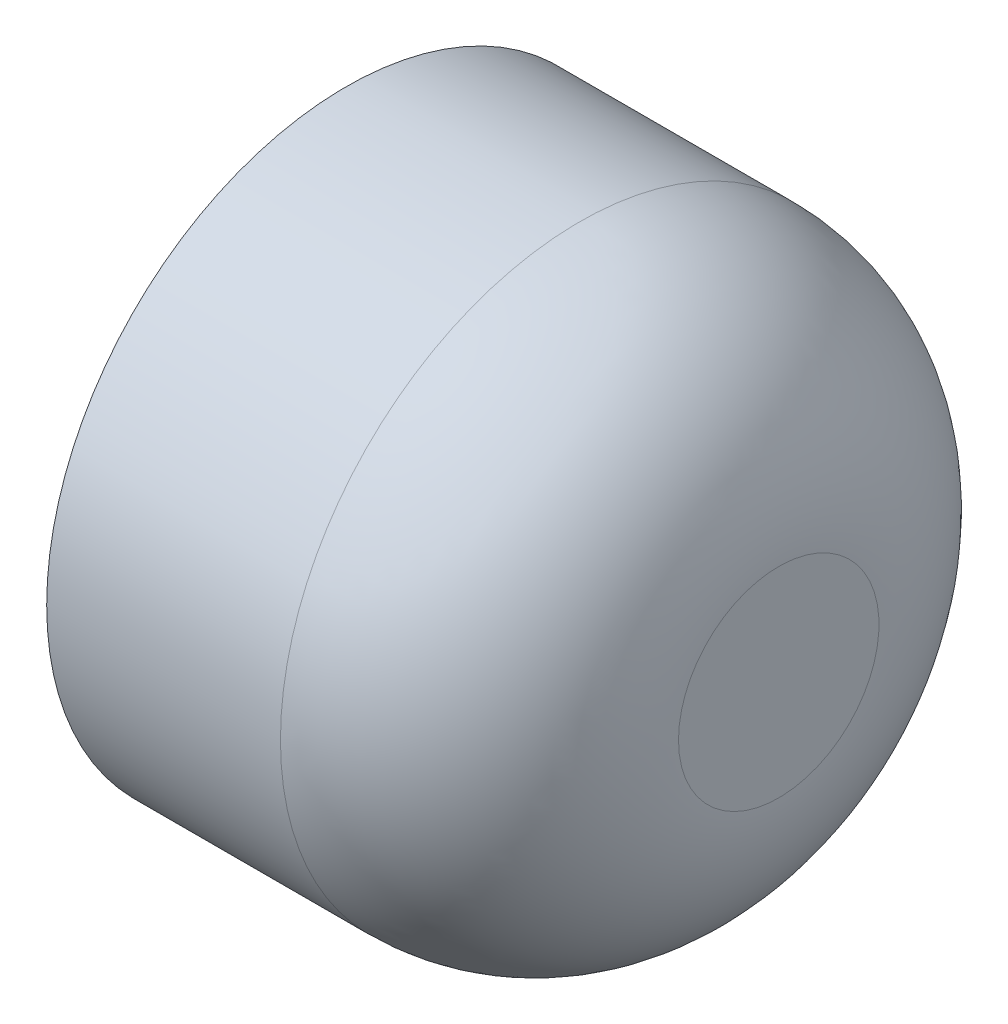
ISO-10303-21;
HEADER;
FILE_DESCRIPTION(('STEP AP214'),'2;1');
FILE_NAME('part.step','',(''),(''),'','','');
FILE_SCHEMA(('AUTOMOTIVE_DESIGN { 1 0 10303 214 1 1 1 1 }'));
ENDSEC;
DATA;
#1=APPLICATION_CONTEXT('core data for automotive mechanical design processes');
#2=APPLICATION_PROTOCOL_DEFINITION('international standard','automotive_design',2000,#1);
#3=PRODUCT_CONTEXT('',#1,'mechanical');
#4=PRODUCT('Part','Part','',(#3));
#5=PRODUCT_RELATED_PRODUCT_CATEGORY('part','',(#4));
#6=PRODUCT_DEFINITION_FORMATION('','',#4);
#7=PRODUCT_DEFINITION_CONTEXT('part definition',#1,'design');
#8=PRODUCT_DEFINITION('design','',#6,#7);
#9=PRODUCT_DEFINITION_SHAPE('','',#8);
#10=(LENGTH_UNIT() NAMED_UNIT(*) SI_UNIT(.MILLI.,.METRE.));
#11=(NAMED_UNIT(*) PLANE_ANGLE_UNIT() SI_UNIT($,.RADIAN.));
#12=(NAMED_UNIT(*) SI_UNIT($,.STERADIAN.) SOLID_ANGLE_UNIT());
#13=UNCERTAINTY_MEASURE_WITH_UNIT(LENGTH_MEASURE(1.E-05),#10,'distance_accuracy_value','');
#14=(GEOMETRIC_REPRESENTATION_CONTEXT(3) GLOBAL_UNCERTAINTY_ASSIGNED_CONTEXT((#13)) GLOBAL_UNIT_ASSIGNED_CONTEXT((#10,
#11,#12)) REPRESENTATION_CONTEXT('',''));
#15=CARTESIAN_POINT('',(0.,0.,0.));
#16=DIRECTION('',(0.,0.,1.));
#17=DIRECTION('',(1.,0.,0.));
#18=AXIS2_PLACEMENT_3D('',#15,#16,#17);
#19=CARTESIAN_POINT('',(7.06084768465247,0.,0.));
#20=DIRECTION('',(-1.,0.,0.));
#21=DIRECTION('',(0.,0.,1.));
#22=AXIS2_PLACEMENT_3D('',#19,#20,#21);
#23=DEGENERATE_TOROIDAL_SURFACE('',#22,9.52382631194564,30.5527329793909,.T.);
#24=CARTESIAN_POINT('',(13.9366262737168,0.,0.));
#25=DIRECTION('',(-1.,0.,0.));
#26=DIRECTION('',(0.,0.,1.));
#27=AXIS2_PLACEMENT_3D('',#24,#25,#26);
#28=CIRCLE('',#27,39.2928229578544);
#29=CARTESIAN_POINT('',(13.9366262737168,0.,39.2928229578544));
#30=VERTEX_POINT('',#29);
#31=EDGE_CURVE('E55',#30,#30,#28,.T.);
#32=ORIENTED_EDGE('',*,*,#31,.T.);
#33=EDGE_LOOP('',(#32));
#34=FACE_BOUND('',#33,.T.);
#35=CARTESIAN_POINT('',(37.6135806640434,0.,0.));
#36=DIRECTION('',(-1.,0.,0.));
#37=DIRECTION('',(0.,0.,1.));
#38=AXIS2_PLACEMENT_3D('',#35,#36,#37);
#39=CIRCLE('',#38,9.52382631194564);
#40=CARTESIAN_POINT('',(37.6135806640434,0.,9.52382631194564));
#41=VERTEX_POINT('',#40);
#42=EDGE_CURVE('E10',#41,#41,#39,.T.);
#43=ORIENTED_EDGE('',*,*,#42,.F.);
#44=EDGE_LOOP('',(#43));
#45=FACE_BOUND('',#44,.T.);
#46=ADVANCED_FACE('F33',(#34,#45),#23,.F.);
#47=CARTESIAN_POINT('',(37.6135806640434,0.,0.));
#48=DIRECTION('',(1.,0.,0.));
#49=DIRECTION('',(0.,0.,-1.));
#50=AXIS2_PLACEMENT_3D('',#47,#48,#49);
#51=PLANE('',#50);
#52=ORIENTED_EDGE('',*,*,#42,.T.);
#53=EDGE_LOOP('',(#52));
#54=FACE_BOUND('',#53,.T.);
#55=ADVANCED_FACE('F79',(#54),#51,.F.);
#56=CARTESIAN_POINT('',(41.4462345782951,0.,0.));
#57=DIRECTION('',(1.,0.,0.));
#58=DIRECTION('',(0.,0.,-1.));
#59=AXIS2_PLACEMENT_3D('',#56,#57,#58);
#60=PLANE('',#59);
#61=CARTESIAN_POINT('',(41.4462345782951,0.,0.));
#62=DIRECTION('',(-1.,0.,0.));
#63=DIRECTION('',(0.,0.,1.));
#64=AXIS2_PLACEMENT_3D('',#61,#62,#63);
#65=CIRCLE('',#64,13.8771210498262);
#66=CARTESIAN_POINT('',(41.4462345782951,0.,13.8771210498262));
#67=VERTEX_POINT('',#66);
#68=EDGE_CURVE('E39',#67,#67,#65,.T.);
#69=ORIENTED_EDGE('',*,*,#68,.F.);
#70=EDGE_LOOP('',(#69));
#71=FACE_BOUND('',#70,.T.);
#72=ADVANCED_FACE('F83',(#71),#60,.T.);
#73=CARTESIAN_POINT('',(13.8954174951645,0.,0.));
#74=DIRECTION('',(-1.,0.,0.));
#75=DIRECTION('',(0.,0.,1.));
#76=AXIS2_PLACEMENT_3D('',#73,#74,#75);
#77=DEGENERATE_TOROIDAL_SURFACE('',#76,13.8771210498262,27.5508170831306,.T.);
#78=CARTESIAN_POINT('',(13.8954174951645,0.,0.));
#79=DIRECTION('',(-1.,0.,0.));
#80=DIRECTION('',(0.,0.,1.));
#81=AXIS2_PLACEMENT_3D('',#78,#79,#80);
#82=CIRCLE('',#81,41.4279381329568);
#83=CARTESIAN_POINT('',(13.8954174951645,0.,41.4279381329568));
#84=VERTEX_POINT('',#83);
#85=EDGE_CURVE('E43',#84,#84,#82,.T.);
#86=ORIENTED_EDGE('',*,*,#85,.F.);
#87=EDGE_LOOP('',(#86));
#88=FACE_BOUND('',#87,.T.);
#89=ORIENTED_EDGE('',*,*,#68,.T.);
#90=EDGE_LOOP('',(#89));
#91=FACE_BOUND('',#90,.T.);
#92=ADVANCED_FACE('F75',(#88,#91),#77,.T.);
#93=CARTESIAN_POINT('',(0.,0.,0.));
#94=DIRECTION('',(-1.,0.,0.));
#95=DIRECTION('',(0.,0.,1.));
#96=AXIS2_PLACEMENT_3D('',#93,#94,#95);
#97=CYLINDRICAL_SURFACE('',#96,41.4279381329568);
#98=ORIENTED_EDGE('',*,*,#85,.T.);
#99=EDGE_LOOP('',(#98));
#100=FACE_BOUND('',#99,.T.);
#101=CARTESIAN_POINT('',(-18.4618028297315,0.,0.));
#102=DIRECTION('',(-1.,0.,0.));
#103=DIRECTION('',(0.,0.,1.));
#104=AXIS2_PLACEMENT_3D('',#101,#102,#103);
#105=CIRCLE('',#104,41.4279381329568);
#106=CARTESIAN_POINT('',(-18.4618028297315,0.,41.4279381329568));
#107=VERTEX_POINT('',#106);
#108=EDGE_CURVE('E47',#107,#107,#105,.T.);
#109=ORIENTED_EDGE('',*,*,#108,.F.);
#110=EDGE_LOOP('',(#109));
#111=FACE_BOUND('',#110,.T.);
#112=ADVANCED_FACE('F69',(#100,#111),#97,.T.);
#113=CARTESIAN_POINT('',(-18.4618028297315,0.,0.));
#114=DIRECTION('',(-1.,0.,0.));
#115=DIRECTION('',(0.,0.,1.));
#116=AXIS2_PLACEMENT_3D('',#113,#114,#115);
#117=PLANE('',#116);
#118=ORIENTED_EDGE('',*,*,#108,.T.);
#119=EDGE_LOOP('',(#118));
#120=FACE_BOUND('',#119,.T.);
#121=CARTESIAN_POINT('',(-18.4618028297315,0.,0.));
#122=DIRECTION('',(-1.,0.,0.));
#123=DIRECTION('',(0.,0.,1.));
#124=AXIS2_PLACEMENT_3D('',#121,#122,#123);
#125=CIRCLE('',#124,39.2928229578544);
#126=CARTESIAN_POINT('',(-18.4618028297315,0.,39.2928229578544));
#127=VERTEX_POINT('',#126);
#128=EDGE_CURVE('E52',#127,#127,#125,.T.);
#129=ORIENTED_EDGE('',*,*,#128,.F.);
#130=EDGE_LOOP('',(#129));
#131=FACE_BOUND('',#130,.T.);
#132=ADVANCED_FACE('F64',(#120,#131),#117,.T.);
#133=CARTESIAN_POINT('',(0.,0.,0.));
#134=DIRECTION('',(-1.,0.,0.));
#135=DIRECTION('',(0.,0.,1.));
#136=AXIS2_PLACEMENT_3D('',#133,#134,#135);
#137=CYLINDRICAL_SURFACE('',#136,39.2928229578544);
#138=ORIENTED_EDGE('',*,*,#31,.F.);
#139=EDGE_LOOP('',(#138));
#140=FACE_BOUND('',#139,.T.);
#141=ORIENTED_EDGE('',*,*,#128,.T.);
#142=EDGE_LOOP('',(#141));
#143=FACE_BOUND('',#142,.T.);
#144=ADVANCED_FACE('F61',(#140,#143),#137,.F.);
#145=CLOSED_SHELL('',(#46,#55,#72,#92,#112,#132,#144));
#146=MANIFOLD_SOLID_BREP('B2',#145);
#147=ADVANCED_BREP_SHAPE_REPRESENTATION('',(#18,#146),#14);
#148=SHAPE_DEFINITION_REPRESENTATION(#9,#147);
ENDSEC;
END-ISO-10303-21;
